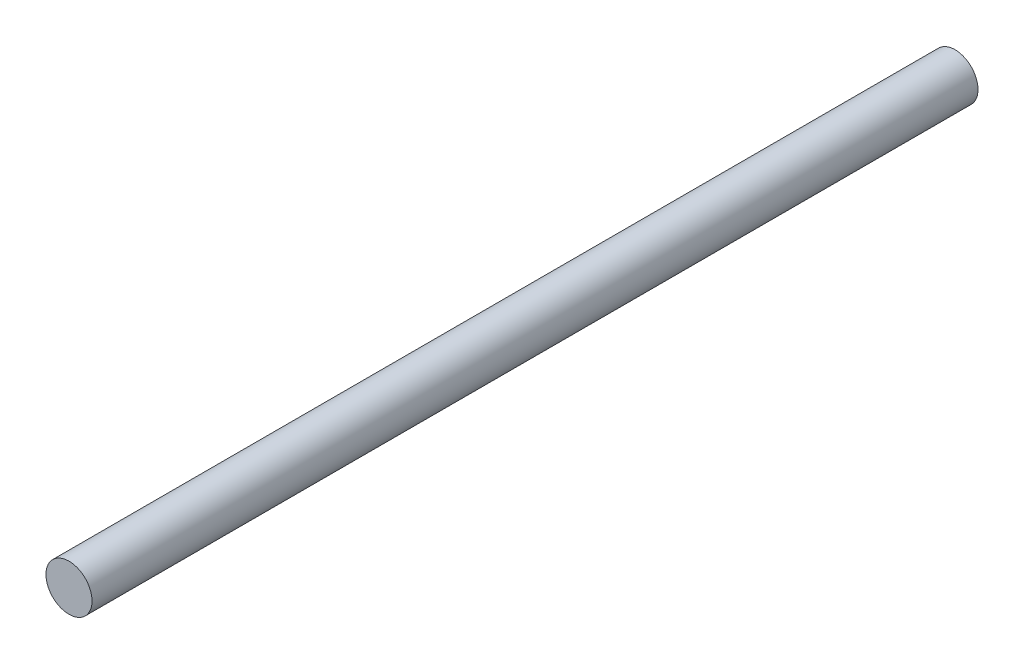
ISO-10303-21;
HEADER;
FILE_DESCRIPTION(('STEP AP214'),'2;1');
FILE_NAME('part.step','',(''),(''),'','','');
FILE_SCHEMA(('AUTOMOTIVE_DESIGN { 1 0 10303 214 1 1 1 1 }'));
ENDSEC;
DATA;
#1=APPLICATION_CONTEXT('core data for automotive mechanical design processes');
#2=APPLICATION_PROTOCOL_DEFINITION('international standard','automotive_design',2000,#1);
#3=PRODUCT_CONTEXT('',#1,'mechanical');
#4=PRODUCT('Part','Part','',(#3));
#5=PRODUCT_RELATED_PRODUCT_CATEGORY('part','',(#4));
#6=PRODUCT_DEFINITION_FORMATION('','',#4);
#7=PRODUCT_DEFINITION_CONTEXT('part definition',#1,'design');
#8=PRODUCT_DEFINITION('design','',#6,#7);
#9=PRODUCT_DEFINITION_SHAPE('','',#8);
#10=(LENGTH_UNIT() NAMED_UNIT(*) SI_UNIT(.MILLI.,.METRE.));
#11=(NAMED_UNIT(*) PLANE_ANGLE_UNIT() SI_UNIT($,.RADIAN.));
#12=(NAMED_UNIT(*) SI_UNIT($,.STERADIAN.) SOLID_ANGLE_UNIT());
#13=UNCERTAINTY_MEASURE_WITH_UNIT(LENGTH_MEASURE(1.E-05),#10,'distance_accuracy_value','');
#14=(GEOMETRIC_REPRESENTATION_CONTEXT(3) GLOBAL_UNCERTAINTY_ASSIGNED_CONTEXT((#13)) GLOBAL_UNIT_ASSIGNED_CONTEXT((#10,
#11,#12)) REPRESENTATION_CONTEXT('',''));
#15=CARTESIAN_POINT('',(0.,0.,0.));
#16=DIRECTION('',(0.,0.,1.));
#17=DIRECTION('',(1.,0.,0.));
#18=AXIS2_PLACEMENT_3D('',#15,#16,#17);
#19=CARTESIAN_POINT('',(0.,0.,150.));
#20=DIRECTION('',(0.,0.,-1.));
#21=DIRECTION('',(-1.,0.,0.));
#22=AXIS2_PLACEMENT_3D('',#19,#20,#21);
#23=CYLINDRICAL_SURFACE('',#22,3.9);
#24=CARTESIAN_POINT('',(0.,0.,150.));
#25=DIRECTION('',(0.,0.,1.));
#26=DIRECTION('',(1.,0.,0.));
#27=AXIS2_PLACEMENT_3D('',#24,#25,#26);
#28=CIRCLE('',#27,3.9);
#29=CARTESIAN_POINT('',(3.9,0.,150.));
#30=VERTEX_POINT('',#29);
#31=EDGE_CURVE('E10',#30,#30,#28,.T.);
#32=ORIENTED_EDGE('',*,*,#31,.F.);
#33=EDGE_LOOP('',(#32));
#34=FACE_BOUND('',#33,.T.);
#35=CARTESIAN_POINT('',(0.,0.,0.));
#36=DIRECTION('',(0.,0.,1.));
#37=DIRECTION('',(1.,0.,0.));
#38=AXIS2_PLACEMENT_3D('',#35,#36,#37);
#39=CIRCLE('',#38,3.9);
#40=CARTESIAN_POINT('',(3.9,0.,0.));
#41=VERTEX_POINT('',#40);
#42=EDGE_CURVE('E33',#41,#41,#39,.T.);
#43=ORIENTED_EDGE('',*,*,#42,.T.);
#44=EDGE_LOOP('',(#43));
#45=FACE_BOUND('',#44,.T.);
#46=ADVANCED_FACE('F30',(#34,#45),#23,.T.);
#47=CARTESIAN_POINT('',(0.,0.,150.));
#48=DIRECTION('',(0.,0.,1.));
#49=DIRECTION('',(1.,0.,0.));
#50=AXIS2_PLACEMENT_3D('',#47,#48,#49);
#51=PLANE('',#50);
#52=ORIENTED_EDGE('',*,*,#31,.T.);
#53=EDGE_LOOP('',(#52));
#54=FACE_BOUND('',#53,.T.);
#55=ADVANCED_FACE('F45',(#54),#51,.T.);
#56=CARTESIAN_POINT('',(0.,0.,0.));
#57=DIRECTION('',(0.,0.,1.));
#58=DIRECTION('',(1.,0.,0.));
#59=AXIS2_PLACEMENT_3D('',#56,#57,#58);
#60=PLANE('',#59);
#61=ORIENTED_EDGE('',*,*,#42,.F.);
#62=EDGE_LOOP('',(#61));
#63=FACE_BOUND('',#62,.T.);
#64=ADVANCED_FACE('F43',(#63),#60,.F.);
#65=CLOSED_SHELL('',(#46,#55,#64));
#66=MANIFOLD_SOLID_BREP('B2',#65);
#67=ADVANCED_BREP_SHAPE_REPRESENTATION('',(#18,#66),#14);
#68=SHAPE_DEFINITION_REPRESENTATION(#9,#67);
ENDSEC;
END-ISO-10303-21;
